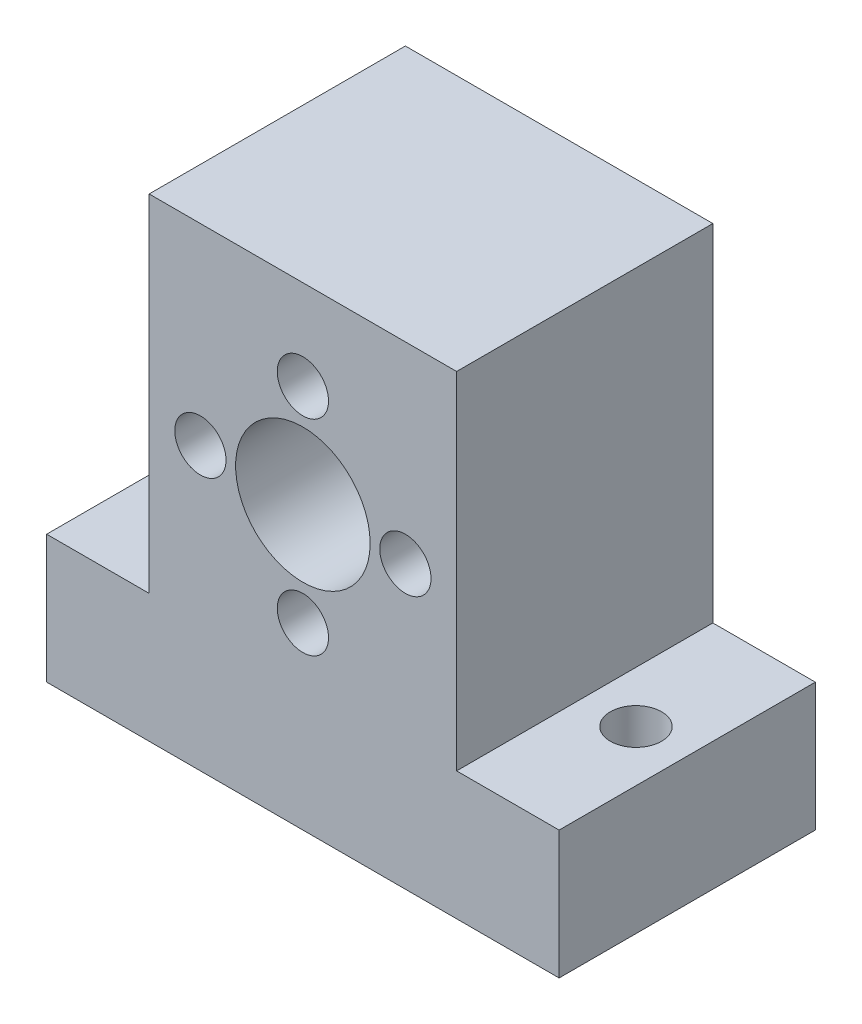
ISO-10303-21;
HEADER;
FILE_DESCRIPTION(('STEP AP214'),'2;1');
FILE_NAME('part.step','',(''),(''),'','','');
FILE_SCHEMA(('AUTOMOTIVE_DESIGN { 1 0 10303 214 1 1 1 1 }'));
ENDSEC;
DATA;
#1=APPLICATION_CONTEXT('core data for automotive mechanical design processes');
#2=APPLICATION_PROTOCOL_DEFINITION('international standard','automotive_design',2000,#1);
#3=PRODUCT_CONTEXT('',#1,'mechanical');
#4=PRODUCT('Part','Part','',(#3));
#5=PRODUCT_RELATED_PRODUCT_CATEGORY('part','',(#4));
#6=PRODUCT_DEFINITION_FORMATION('','',#4);
#7=PRODUCT_DEFINITION_CONTEXT('part definition',#1,'design');
#8=PRODUCT_DEFINITION('design','',#6,#7);
#9=PRODUCT_DEFINITION_SHAPE('','',#8);
#10=(LENGTH_UNIT() NAMED_UNIT(*) SI_UNIT(.MILLI.,.METRE.));
#11=(NAMED_UNIT(*) PLANE_ANGLE_UNIT() SI_UNIT($,.RADIAN.));
#12=(NAMED_UNIT(*) SI_UNIT($,.STERADIAN.) SOLID_ANGLE_UNIT());
#13=UNCERTAINTY_MEASURE_WITH_UNIT(LENGTH_MEASURE(1.E-05),#10,'distance_accuracy_value','');
#14=(GEOMETRIC_REPRESENTATION_CONTEXT(3) GLOBAL_UNCERTAINTY_ASSIGNED_CONTEXT((#13)) GLOBAL_UNIT_ASSIGNED_CONTEXT((#10,
#11,#12)) REPRESENTATION_CONTEXT('',''));
#15=CARTESIAN_POINT('',(0.,0.,0.));
#16=DIRECTION('',(0.,0.,1.));
#17=DIRECTION('',(1.,0.,0.));
#18=AXIS2_PLACEMENT_3D('',#15,#16,#17);
#19=CARTESIAN_POINT('',(0.,0.,20.));
#20=DIRECTION('',(0.,0.,-1.));
#21=DIRECTION('',(-1.,0.,0.));
#22=AXIS2_PLACEMENT_3D('',#19,#20,#21);
#23=PLANE('',#22);
#24=CARTESIAN_POINT('',(-8.,0.,20.));
#25=DIRECTION('',(0.,0.,1.));
#26=DIRECTION('',(1.,0.,0.));
#27=AXIS2_PLACEMENT_3D('',#24,#25,#26);
#28=CIRCLE('',#27,2.);
#29=CARTESIAN_POINT('',(-6.,0.,20.));
#30=VERTEX_POINT('',#29);
#31=EDGE_CURVE('E174',#30,#30,#28,.T.);
#32=ORIENTED_EDGE('',*,*,#31,.F.);
#33=EDGE_LOOP('',(#32));
#34=FACE_BOUND('',#33,.T.);
#35=CARTESIAN_POINT('',(0.,-8.,20.));
#36=DIRECTION('',(0.,0.,1.));
#37=DIRECTION('',(1.,0.,0.));
#38=AXIS2_PLACEMENT_3D('',#35,#36,#37);
#39=CIRCLE('',#38,2.);
#40=CARTESIAN_POINT('',(1.99999999999994,-8.,20.));
#41=VERTEX_POINT('',#40);
#42=EDGE_CURVE('E180',#41,#41,#39,.T.);
#43=ORIENTED_EDGE('',*,*,#42,.F.);
#44=EDGE_LOOP('',(#43));
#45=FACE_BOUND('',#44,.T.);
#46=CARTESIAN_POINT('',(8.,0.,20.));
#47=DIRECTION('',(0.,0.,1.));
#48=DIRECTION('',(1.,0.,0.));
#49=AXIS2_PLACEMENT_3D('',#46,#47,#48);
#50=CIRCLE('',#49,2.);
#51=CARTESIAN_POINT('',(10.,0.,20.));
#52=VERTEX_POINT('',#51);
#53=EDGE_CURVE('E186',#52,#52,#50,.T.);
#54=ORIENTED_EDGE('',*,*,#53,.F.);
#55=EDGE_LOOP('',(#54));
#56=FACE_BOUND('',#55,.T.);
#57=CARTESIAN_POINT('',(0.,8.,20.));
#58=DIRECTION('',(0.,0.,1.));
#59=DIRECTION('',(1.,0.,0.));
#60=AXIS2_PLACEMENT_3D('',#57,#58,#59);
#61=CIRCLE('',#60,2.);
#62=CARTESIAN_POINT('',(2.,8.,20.));
#63=VERTEX_POINT('',#62);
#64=EDGE_CURVE('E192',#63,#63,#61,.T.);
#65=ORIENTED_EDGE('',*,*,#64,.F.);
#66=EDGE_LOOP('',(#65));
#67=FACE_BOUND('',#66,.T.);
#68=CARTESIAN_POINT('',(0.,0.,20.));
#69=DIRECTION('',(0.,0.,1.));
#70=DIRECTION('',(1.,0.,0.));
#71=AXIS2_PLACEMENT_3D('',#68,#69,#70);
#72=CIRCLE('',#71,5.25);
#73=CARTESIAN_POINT('',(5.25,0.,20.));
#74=VERTEX_POINT('',#73);
#75=EDGE_CURVE('E133',#74,#74,#72,.T.);
#76=ORIENTED_EDGE('',*,*,#75,.F.);
#77=EDGE_LOOP('',(#76));
#78=FACE_BOUND('',#77,.T.);
#79=DIRECTION('',(1.,0.,0.));
#80=VECTOR('',#79,1.);
#81=CARTESIAN_POINT('',(0.,-12.,20.));
#82=LINE('',#81,#80);
#83=CARTESIAN_POINT('',(-20.,-12.,20.));
#84=VERTEX_POINT('',#83);
#85=CARTESIAN_POINT('',(-12.,-12.,20.));
#86=VERTEX_POINT('',#85);
#87=EDGE_CURVE('E104',#84,#86,#82,.T.);
#88=ORIENTED_EDGE('',*,*,#87,.F.);
#89=DIRECTION('',(0.,-1.,0.));
#90=VECTOR('',#89,1.);
#91=CARTESIAN_POINT('',(-20.,-22.,20.));
#92=LINE('',#91,#90);
#93=CARTESIAN_POINT('',(-20.,-22.,20.));
#94=VERTEX_POINT('',#93);
#95=EDGE_CURVE('E114',#84,#94,#92,.T.);
#96=ORIENTED_EDGE('',*,*,#95,.T.);
#97=DIRECTION('',(1.,0.,0.));
#98=VECTOR('',#97,1.);
#99=CARTESIAN_POINT('',(-20.,-22.,20.));
#100=LINE('',#99,#98);
#101=CARTESIAN_POINT('',(20.,-22.,20.));
#102=VERTEX_POINT('',#101);
#103=EDGE_CURVE('E121',#94,#102,#100,.T.);
#104=ORIENTED_EDGE('',*,*,#103,.T.);
#105=DIRECTION('',(0.,1.,0.));
#106=VECTOR('',#105,1.);
#107=CARTESIAN_POINT('',(20.,-22.,20.));
#108=LINE('',#107,#106);
#109=CARTESIAN_POINT('',(20.,-12.,20.));
#110=VERTEX_POINT('',#109);
#111=EDGE_CURVE('E125',#102,#110,#108,.T.);
#112=ORIENTED_EDGE('',*,*,#111,.T.);
#113=DIRECTION('',(-1.,0.,0.));
#114=VECTOR('',#113,1.);
#115=CARTESIAN_POINT('',(0.,-12.,20.));
#116=LINE('',#115,#114);
#117=CARTESIAN_POINT('',(12.,-12.,20.));
#118=VERTEX_POINT('',#117);
#119=EDGE_CURVE('E152',#110,#118,#116,.T.);
#120=ORIENTED_EDGE('',*,*,#119,.T.);
#121=DIRECTION('',(0.,1.,0.));
#122=VECTOR('',#121,1.);
#123=CARTESIAN_POINT('',(12.,0.,20.));
#124=LINE('',#123,#122);
#125=CARTESIAN_POINT('',(12.,15.,20.));
#126=VERTEX_POINT('',#125);
#127=EDGE_CURVE('E155',#118,#126,#124,.T.);
#128=ORIENTED_EDGE('',*,*,#127,.T.);
#129=DIRECTION('',(-1.,0.,0.));
#130=VECTOR('',#129,1.);
#131=CARTESIAN_POINT('',(-20.,15.,20.));
#132=LINE('',#131,#130);
#133=CARTESIAN_POINT('',(-12.,15.,20.));
#134=VERTEX_POINT('',#133);
#135=EDGE_CURVE('E122',#126,#134,#132,.T.);
#136=ORIENTED_EDGE('',*,*,#135,.T.);
#137=DIRECTION('',(0.,1.,0.));
#138=VECTOR('',#137,1.);
#139=CARTESIAN_POINT('',(-12.,0.,20.));
#140=LINE('',#139,#138);
#141=EDGE_CURVE('E110',#86,#134,#140,.T.);
#142=ORIENTED_EDGE('',*,*,#141,.F.);
#143=EDGE_LOOP('',(#88,#96,#104,#112,#120,#128,#136,#142));
#144=FACE_BOUND('',#143,.T.);
#145=ADVANCED_FACE('F35',(#34,#45,#56,#67,#78,#144),#23,.F.);
#146=CARTESIAN_POINT('',(0.,0.,0.));
#147=DIRECTION('',(0.,0.,-1.));
#148=DIRECTION('',(-1.,0.,0.));
#149=AXIS2_PLACEMENT_3D('',#146,#147,#148);
#150=PLANE('',#149);
#151=CARTESIAN_POINT('',(0.,-8.,0.));
#152=DIRECTION('',(0.,0.,1.));
#153=DIRECTION('',(1.,0.,0.));
#154=AXIS2_PLACEMENT_3D('',#151,#152,#153);
#155=CIRCLE('',#154,2.);
#156=CARTESIAN_POINT('',(1.99999999999994,-8.,0.));
#157=VERTEX_POINT('',#156);
#158=EDGE_CURVE('E177',#157,#157,#155,.T.);
#159=ORIENTED_EDGE('',*,*,#158,.T.);
#160=EDGE_LOOP('',(#159));
#161=FACE_BOUND('',#160,.T.);
#162=CARTESIAN_POINT('',(0.,8.,0.));
#163=DIRECTION('',(0.,0.,1.));
#164=DIRECTION('',(1.,0.,0.));
#165=AXIS2_PLACEMENT_3D('',#162,#163,#164);
#166=CIRCLE('',#165,2.);
#167=CARTESIAN_POINT('',(2.,8.,0.));
#168=VERTEX_POINT('',#167);
#169=EDGE_CURVE('E189',#168,#168,#166,.T.);
#170=ORIENTED_EDGE('',*,*,#169,.T.);
#171=EDGE_LOOP('',(#170));
#172=FACE_BOUND('',#171,.T.);
#173=CARTESIAN_POINT('',(0.,0.,0.));
#174=DIRECTION('',(0.,0.,1.));
#175=DIRECTION('',(1.,0.,0.));
#176=AXIS2_PLACEMENT_3D('',#173,#174,#175);
#177=CIRCLE('',#176,5.25);
#178=CARTESIAN_POINT('',(5.25,0.,0.));
#179=VERTEX_POINT('',#178);
#180=EDGE_CURVE('E195',#179,#179,#177,.T.);
#181=ORIENTED_EDGE('',*,*,#180,.T.);
#182=EDGE_LOOP('',(#181));
#183=FACE_BOUND('',#182,.T.);
#184=CARTESIAN_POINT('',(8.,0.,0.));
#185=DIRECTION('',(0.,0.,1.));
#186=DIRECTION('',(1.,0.,0.));
#187=AXIS2_PLACEMENT_3D('',#184,#185,#186);
#188=CIRCLE('',#187,2.);
#189=CARTESIAN_POINT('',(10.,0.,0.));
#190=VERTEX_POINT('',#189);
#191=EDGE_CURVE('E183',#190,#190,#188,.T.);
#192=ORIENTED_EDGE('',*,*,#191,.T.);
#193=EDGE_LOOP('',(#192));
#194=FACE_BOUND('',#193,.T.);
#195=CARTESIAN_POINT('',(-8.,0.,0.));
#196=DIRECTION('',(0.,0.,1.));
#197=DIRECTION('',(1.,0.,0.));
#198=AXIS2_PLACEMENT_3D('',#195,#196,#197);
#199=CIRCLE('',#198,2.);
#200=CARTESIAN_POINT('',(-6.,0.,0.));
#201=VERTEX_POINT('',#200);
#202=EDGE_CURVE('E171',#201,#201,#199,.T.);
#203=ORIENTED_EDGE('',*,*,#202,.T.);
#204=EDGE_LOOP('',(#203));
#205=FACE_BOUND('',#204,.T.);
#206=DIRECTION('',(0.,-1.,0.));
#207=VECTOR('',#206,1.);
#208=CARTESIAN_POINT('',(-20.,-22.,0.));
#209=LINE('',#208,#207);
#210=CARTESIAN_POINT('',(-20.,-12.,0.));
#211=VERTEX_POINT('',#210);
#212=CARTESIAN_POINT('',(-20.,-22.,0.));
#213=VERTEX_POINT('',#212);
#214=EDGE_CURVE('E136',#211,#213,#209,.T.);
#215=ORIENTED_EDGE('',*,*,#214,.F.);
#216=DIRECTION('',(1.,0.,0.));
#217=VECTOR('',#216,1.);
#218=CARTESIAN_POINT('',(0.,-12.,0.));
#219=LINE('',#218,#217);
#220=CARTESIAN_POINT('',(-12.,-12.,0.));
#221=VERTEX_POINT('',#220);
#222=EDGE_CURVE('E60',#211,#221,#219,.T.);
#223=ORIENTED_EDGE('',*,*,#222,.T.);
#224=DIRECTION('',(0.,1.,0.));
#225=VECTOR('',#224,1.);
#226=CARTESIAN_POINT('',(-12.,0.,0.));
#227=LINE('',#226,#225);
#228=CARTESIAN_POINT('',(-12.,15.,0.));
#229=VERTEX_POINT('',#228);
#230=EDGE_CURVE('E117',#221,#229,#227,.T.);
#231=ORIENTED_EDGE('',*,*,#230,.T.);
#232=DIRECTION('',(-1.,0.,0.));
#233=VECTOR('',#232,1.);
#234=CARTESIAN_POINT('',(-20.,15.,0.));
#235=LINE('',#234,#233);
#236=CARTESIAN_POINT('',(12.,15.,0.));
#237=VERTEX_POINT('',#236);
#238=EDGE_CURVE('E132',#237,#229,#235,.T.);
#239=ORIENTED_EDGE('',*,*,#238,.F.);
#240=DIRECTION('',(0.,1.,0.));
#241=VECTOR('',#240,1.);
#242=CARTESIAN_POINT('',(12.,0.,0.));
#243=LINE('',#242,#241);
#244=CARTESIAN_POINT('',(12.,-12.,0.));
#245=VERTEX_POINT('',#244);
#246=EDGE_CURVE('E52',#245,#237,#243,.T.);
#247=ORIENTED_EDGE('',*,*,#246,.F.);
#248=DIRECTION('',(-1.,0.,0.));
#249=VECTOR('',#248,1.);
#250=CARTESIAN_POINT('',(0.,-12.,0.));
#251=LINE('',#250,#249);
#252=CARTESIAN_POINT('',(20.,-12.,0.));
#253=VERTEX_POINT('',#252);
#254=EDGE_CURVE('E159',#253,#245,#251,.T.);
#255=ORIENTED_EDGE('',*,*,#254,.F.);
#256=DIRECTION('',(0.,1.,0.));
#257=VECTOR('',#256,1.);
#258=CARTESIAN_POINT('',(20.,-22.,0.));
#259=LINE('',#258,#257);
#260=CARTESIAN_POINT('',(20.,-22.,0.));
#261=VERTEX_POINT('',#260);
#262=EDGE_CURVE('E129',#261,#253,#259,.T.);
#263=ORIENTED_EDGE('',*,*,#262,.F.);
#264=DIRECTION('',(1.,0.,0.));
#265=VECTOR('',#264,1.);
#266=CARTESIAN_POINT('',(-20.,-22.,0.));
#267=LINE('',#266,#265);
#268=EDGE_CURVE('E138',#213,#261,#267,.T.);
#269=ORIENTED_EDGE('',*,*,#268,.F.);
#270=EDGE_LOOP('',(#215,#223,#231,#239,#247,#255,#263,#269));
#271=FACE_BOUND('',#270,.T.);
#272=ADVANCED_FACE('F212',(#161,#172,#183,#194,#205,#271),#150,.T.);
#273=CARTESIAN_POINT('',(-20.,15.,20.));
#274=DIRECTION('',(0.,-1.,0.));
#275=DIRECTION('',(1.,0.,0.));
#276=AXIS2_PLACEMENT_3D('',#273,#274,#275);
#277=PLANE('',#276);
#278=DIRECTION('',(0.,0.,-1.));
#279=VECTOR('',#278,1.);
#280=CARTESIAN_POINT('',(-12.,15.,20.));
#281=LINE('',#280,#279);
#282=EDGE_CURVE('E109',#134,#229,#281,.T.);
#283=ORIENTED_EDGE('',*,*,#282,.F.);
#284=ORIENTED_EDGE('',*,*,#135,.F.);
#285=DIRECTION('',(0.,0.,-1.));
#286=VECTOR('',#285,1.);
#287=CARTESIAN_POINT('',(12.,15.,20.));
#288=LINE('',#287,#286);
#289=EDGE_CURVE('E165',#126,#237,#288,.T.);
#290=ORIENTED_EDGE('',*,*,#289,.T.);
#291=ORIENTED_EDGE('',*,*,#238,.T.);
#292=EDGE_LOOP('',(#283,#284,#290,#291));
#293=FACE_BOUND('',#292,.T.);
#294=ADVANCED_FACE('F218',(#293),#277,.F.);
#295=CARTESIAN_POINT('',(-20.,-22.,20.));
#296=DIRECTION('',(1.,0.,0.));
#297=DIRECTION('',(0.,0.,-1.));
#298=AXIS2_PLACEMENT_3D('',#295,#296,#297);
#299=PLANE('',#298);
#300=DIRECTION('',(0.,0.,-1.));
#301=VECTOR('',#300,1.);
#302=CARTESIAN_POINT('',(-20.,-12.,20.));
#303=LINE('',#302,#301);
#304=EDGE_CURVE('E100',#84,#211,#303,.T.);
#305=ORIENTED_EDGE('',*,*,#304,.T.);
#306=ORIENTED_EDGE('',*,*,#214,.T.);
#307=DIRECTION('',(0.,0.,-1.));
#308=VECTOR('',#307,1.);
#309=CARTESIAN_POINT('',(-20.,-22.,20.));
#310=LINE('',#309,#308);
#311=EDGE_CURVE('E11',#94,#213,#310,.T.);
#312=ORIENTED_EDGE('',*,*,#311,.F.);
#313=ORIENTED_EDGE('',*,*,#95,.F.);
#314=EDGE_LOOP('',(#305,#306,#312,#313));
#315=FACE_BOUND('',#314,.T.);
#316=ADVANCED_FACE('F119',(#315),#299,.F.);
#317=CARTESIAN_POINT('',(-16.,-22.,10.));
#318=DIRECTION('',(0.,1.,0.));
#319=DIRECTION('',(0.,0.,1.));
#320=AXIS2_PLACEMENT_3D('',#317,#318,#319);
#321=CYLINDRICAL_SURFACE('',#320,2.);
#322=CARTESIAN_POINT('',(-16.,-22.,10.));
#323=DIRECTION('',(0.,1.,0.));
#324=DIRECTION('',(0.,0.,1.));
#325=AXIS2_PLACEMENT_3D('',#322,#323,#324);
#326=CIRCLE('',#325,2.);
#327=CARTESIAN_POINT('',(-16.,-22.,12.));
#328=VERTEX_POINT('',#327);
#329=EDGE_CURVE('E168',#328,#328,#326,.T.);
#330=ORIENTED_EDGE('',*,*,#329,.F.);
#331=EDGE_LOOP('',(#330));
#332=FACE_BOUND('',#331,.T.);
#333=CARTESIAN_POINT('',(-16.,-12.,10.));
#334=DIRECTION('',(0.,1.,0.));
#335=DIRECTION('',(-1.,0.,0.));
#336=AXIS2_PLACEMENT_3D('',#333,#334,#335);
#337=CIRCLE('',#336,2.);
#338=CARTESIAN_POINT('',(-18.,-12.,10.));
#339=VERTEX_POINT('',#338);
#340=EDGE_CURVE('E141',#339,#339,#337,.F.);
#341=ORIENTED_EDGE('',*,*,#340,.F.);
#342=EDGE_LOOP('',(#341));
#343=FACE_BOUND('',#342,.T.);
#344=ADVANCED_FACE('F249',(#332,#343),#321,.F.);
#345=CARTESIAN_POINT('',(20.,-22.,20.));
#346=DIRECTION('',(-1.,0.,0.));
#347=DIRECTION('',(0.,0.,1.));
#348=AXIS2_PLACEMENT_3D('',#345,#346,#347);
#349=PLANE('',#348);
#350=ORIENTED_EDGE('',*,*,#262,.T.);
#351=DIRECTION('',(0.,0.,-1.));
#352=VECTOR('',#351,1.);
#353=CARTESIAN_POINT('',(20.,-12.,20.));
#354=LINE('',#353,#352);
#355=EDGE_CURVE('E163',#110,#253,#354,.T.);
#356=ORIENTED_EDGE('',*,*,#355,.F.);
#357=ORIENTED_EDGE('',*,*,#111,.F.);
#358=DIRECTION('',(0.,0.,-1.));
#359=VECTOR('',#358,1.);
#360=CARTESIAN_POINT('',(20.,-22.,20.));
#361=LINE('',#360,#359);
#362=EDGE_CURVE('E44',#102,#261,#361,.T.);
#363=ORIENTED_EDGE('',*,*,#362,.T.);
#364=EDGE_LOOP('',(#350,#356,#357,#363));
#365=FACE_BOUND('',#364,.T.);
#366=ADVANCED_FACE('F37',(#365),#349,.F.);
#367=CARTESIAN_POINT('',(-20.,-22.,20.));
#368=DIRECTION('',(0.,1.,0.));
#369=DIRECTION('',(-1.,0.,0.));
#370=AXIS2_PLACEMENT_3D('',#367,#368,#369);
#371=PLANE('',#370);
#372=ORIENTED_EDGE('',*,*,#329,.T.);
#373=EDGE_LOOP('',(#372));
#374=FACE_BOUND('',#373,.T.);
#375=CARTESIAN_POINT('',(16.,-22.,10.));
#376=DIRECTION('',(0.,1.,0.));
#377=DIRECTION('',(0.,0.,-1.));
#378=AXIS2_PLACEMENT_3D('',#375,#376,#377);
#379=CIRCLE('',#378,2.);
#380=CARTESIAN_POINT('',(16.,-22.,8.));
#381=VERTEX_POINT('',#380);
#382=EDGE_CURVE('E146',#381,#381,#379,.T.);
#383=ORIENTED_EDGE('',*,*,#382,.T.);
#384=EDGE_LOOP('',(#383));
#385=FACE_BOUND('',#384,.T.);
#386=ORIENTED_EDGE('',*,*,#268,.T.);
#387=ORIENTED_EDGE('',*,*,#362,.F.);
#388=ORIENTED_EDGE('',*,*,#103,.F.);
#389=ORIENTED_EDGE('',*,*,#311,.T.);
#390=EDGE_LOOP('',(#386,#387,#388,#389));
#391=FACE_BOUND('',#390,.T.);
#392=ADVANCED_FACE('F244',(#374,#385,#391),#371,.F.);
#393=CARTESIAN_POINT('',(0.,0.,20.));
#394=DIRECTION('',(0.,0.,-1.));
#395=DIRECTION('',(-1.,0.,0.));
#396=AXIS2_PLACEMENT_3D('',#393,#394,#395);
#397=CYLINDRICAL_SURFACE('',#396,5.25);
#398=ORIENTED_EDGE('',*,*,#75,.T.);
#399=EDGE_LOOP('',(#398));
#400=FACE_BOUND('',#399,.T.);
#401=ORIENTED_EDGE('',*,*,#180,.F.);
#402=EDGE_LOOP('',(#401));
#403=FACE_BOUND('',#402,.T.);
#404=ADVANCED_FACE('F241',(#400,#403),#397,.F.);
#405=CARTESIAN_POINT('',(0.,8.,20.));
#406=DIRECTION('',(0.,0.,-1.));
#407=DIRECTION('',(-1.,0.,0.));
#408=AXIS2_PLACEMENT_3D('',#405,#406,#407);
#409=CYLINDRICAL_SURFACE('',#408,2.);
#410=ORIENTED_EDGE('',*,*,#64,.T.);
#411=EDGE_LOOP('',(#410));
#412=FACE_BOUND('',#411,.T.);
#413=ORIENTED_EDGE('',*,*,#169,.F.);
#414=EDGE_LOOP('',(#413));
#415=FACE_BOUND('',#414,.T.);
#416=ADVANCED_FACE('F283',(#412,#415),#409,.F.);
#417=CARTESIAN_POINT('',(8.,0.,20.));
#418=DIRECTION('',(0.,0.,-1.));
#419=DIRECTION('',(-1.,0.,0.));
#420=AXIS2_PLACEMENT_3D('',#417,#418,#419);
#421=CYLINDRICAL_SURFACE('',#420,2.);
#422=ORIENTED_EDGE('',*,*,#53,.T.);
#423=EDGE_LOOP('',(#422));
#424=FACE_BOUND('',#423,.T.);
#425=ORIENTED_EDGE('',*,*,#191,.F.);
#426=EDGE_LOOP('',(#425));
#427=FACE_BOUND('',#426,.T.);
#428=ADVANCED_FACE('F290',(#424,#427),#421,.F.);
#429=CARTESIAN_POINT('',(0.,-8.,20.));
#430=DIRECTION('',(0.,0.,-1.));
#431=DIRECTION('',(-1.,0.,0.));
#432=AXIS2_PLACEMENT_3D('',#429,#430,#431);
#433=CYLINDRICAL_SURFACE('',#432,2.);
#434=ORIENTED_EDGE('',*,*,#42,.T.);
#435=EDGE_LOOP('',(#434));
#436=FACE_BOUND('',#435,.T.);
#437=ORIENTED_EDGE('',*,*,#158,.F.);
#438=EDGE_LOOP('',(#437));
#439=FACE_BOUND('',#438,.T.);
#440=ADVANCED_FACE('F297',(#436,#439),#433,.F.);
#441=CARTESIAN_POINT('',(-8.,0.,20.));
#442=DIRECTION('',(0.,0.,-1.));
#443=DIRECTION('',(-1.,0.,0.));
#444=AXIS2_PLACEMENT_3D('',#441,#442,#443);
#445=CYLINDRICAL_SURFACE('',#444,2.);
#446=ORIENTED_EDGE('',*,*,#31,.T.);
#447=EDGE_LOOP('',(#446));
#448=FACE_BOUND('',#447,.T.);
#449=ORIENTED_EDGE('',*,*,#202,.F.);
#450=EDGE_LOOP('',(#449));
#451=FACE_BOUND('',#450,.T.);
#452=ADVANCED_FACE('F305',(#448,#451),#445,.F.);
#453=CARTESIAN_POINT('',(16.,-22.,10.));
#454=DIRECTION('',(0.,1.,0.));
#455=DIRECTION('',(0.,0.,1.));
#456=AXIS2_PLACEMENT_3D('',#453,#454,#455);
#457=CYLINDRICAL_SURFACE('',#456,2.);
#458=CARTESIAN_POINT('',(16.,-12.,10.));
#459=DIRECTION('',(0.,-1.,0.));
#460=DIRECTION('',(1.,0.,0.));
#461=AXIS2_PLACEMENT_3D('',#458,#459,#460);
#462=CIRCLE('',#461,2.);
#463=CARTESIAN_POINT('',(18.,-12.,10.));
#464=VERTEX_POINT('',#463);
#465=EDGE_CURVE('E39',#464,#464,#462,.F.);
#466=ORIENTED_EDGE('',*,*,#465,.T.);
#467=EDGE_LOOP('',(#466));
#468=FACE_BOUND('',#467,.T.);
#469=ORIENTED_EDGE('',*,*,#382,.F.);
#470=EDGE_LOOP('',(#469));
#471=FACE_BOUND('',#470,.T.);
#472=ADVANCED_FACE('F312',(#468,#471),#457,.F.);
#473=CARTESIAN_POINT('',(0.,-12.,20.));
#474=DIRECTION('',(0.,1.,0.));
#475=DIRECTION('',(-1.,0.,0.));
#476=AXIS2_PLACEMENT_3D('',#473,#474,#475);
#477=PLANE('',#476);
#478=ORIENTED_EDGE('',*,*,#222,.F.);
#479=ORIENTED_EDGE('',*,*,#304,.F.);
#480=ORIENTED_EDGE('',*,*,#87,.T.);
#481=DIRECTION('',(0.,0.,-1.));
#482=VECTOR('',#481,1.);
#483=CARTESIAN_POINT('',(-12.,-12.,20.));
#484=LINE('',#483,#482);
#485=EDGE_CURVE('E143',#86,#221,#484,.T.);
#486=ORIENTED_EDGE('',*,*,#485,.T.);
#487=EDGE_LOOP('',(#478,#479,#480,#486));
#488=FACE_BOUND('',#487,.T.);
#489=ORIENTED_EDGE('',*,*,#340,.T.);
#490=EDGE_LOOP('',(#489));
#491=FACE_BOUND('',#490,.T.);
#492=ADVANCED_FACE('F102',(#488,#491),#477,.T.);
#493=CARTESIAN_POINT('',(-12.,0.,20.));
#494=DIRECTION('',(-1.,0.,0.));
#495=DIRECTION('',(0.,0.,1.));
#496=AXIS2_PLACEMENT_3D('',#493,#494,#495);
#497=PLANE('',#496);
#498=ORIENTED_EDGE('',*,*,#230,.F.);
#499=ORIENTED_EDGE('',*,*,#485,.F.);
#500=ORIENTED_EDGE('',*,*,#141,.T.);
#501=ORIENTED_EDGE('',*,*,#282,.T.);
#502=EDGE_LOOP('',(#498,#499,#500,#501));
#503=FACE_BOUND('',#502,.T.);
#504=ADVANCED_FACE('F227',(#503),#497,.T.);
#505=CARTESIAN_POINT('',(0.,-12.,20.));
#506=DIRECTION('',(0.,-1.,0.));
#507=DIRECTION('',(1.,0.,0.));
#508=AXIS2_PLACEMENT_3D('',#505,#506,#507);
#509=PLANE('',#508);
#510=ORIENTED_EDGE('',*,*,#254,.T.);
#511=DIRECTION('',(0.,0.,-1.));
#512=VECTOR('',#511,1.);
#513=CARTESIAN_POINT('',(12.,-12.,20.));
#514=LINE('',#513,#512);
#515=EDGE_CURVE('E158',#118,#245,#514,.T.);
#516=ORIENTED_EDGE('',*,*,#515,.F.);
#517=ORIENTED_EDGE('',*,*,#119,.F.);
#518=ORIENTED_EDGE('',*,*,#355,.T.);
#519=EDGE_LOOP('',(#510,#516,#517,#518));
#520=FACE_BOUND('',#519,.T.);
#521=ORIENTED_EDGE('',*,*,#465,.F.);
#522=EDGE_LOOP('',(#521));
#523=FACE_BOUND('',#522,.T.);
#524=ADVANCED_FACE('F209',(#520,#523),#509,.F.);
#525=CARTESIAN_POINT('',(12.,0.,20.));
#526=DIRECTION('',(-1.,0.,0.));
#527=DIRECTION('',(0.,0.,1.));
#528=AXIS2_PLACEMENT_3D('',#525,#526,#527);
#529=PLANE('',#528);
#530=ORIENTED_EDGE('',*,*,#246,.T.);
#531=ORIENTED_EDGE('',*,*,#289,.F.);
#532=ORIENTED_EDGE('',*,*,#127,.F.);
#533=ORIENTED_EDGE('',*,*,#515,.T.);
#534=EDGE_LOOP('',(#530,#531,#532,#533));
#535=FACE_BOUND('',#534,.T.);
#536=ADVANCED_FACE('F221',(#535),#529,.F.);
#537=CLOSED_SHELL('',(#145,#272,#294,#316,#344,#366,#392,#404,#416,#428,#440,#452,#472,#492,
#504,#524,#536));
#538=MANIFOLD_SOLID_BREP('B2',#537);
#539=ADVANCED_BREP_SHAPE_REPRESENTATION('',(#18,#538),#14);
#540=SHAPE_DEFINITION_REPRESENTATION(#9,#539);
ENDSEC;
END-ISO-10303-21;
